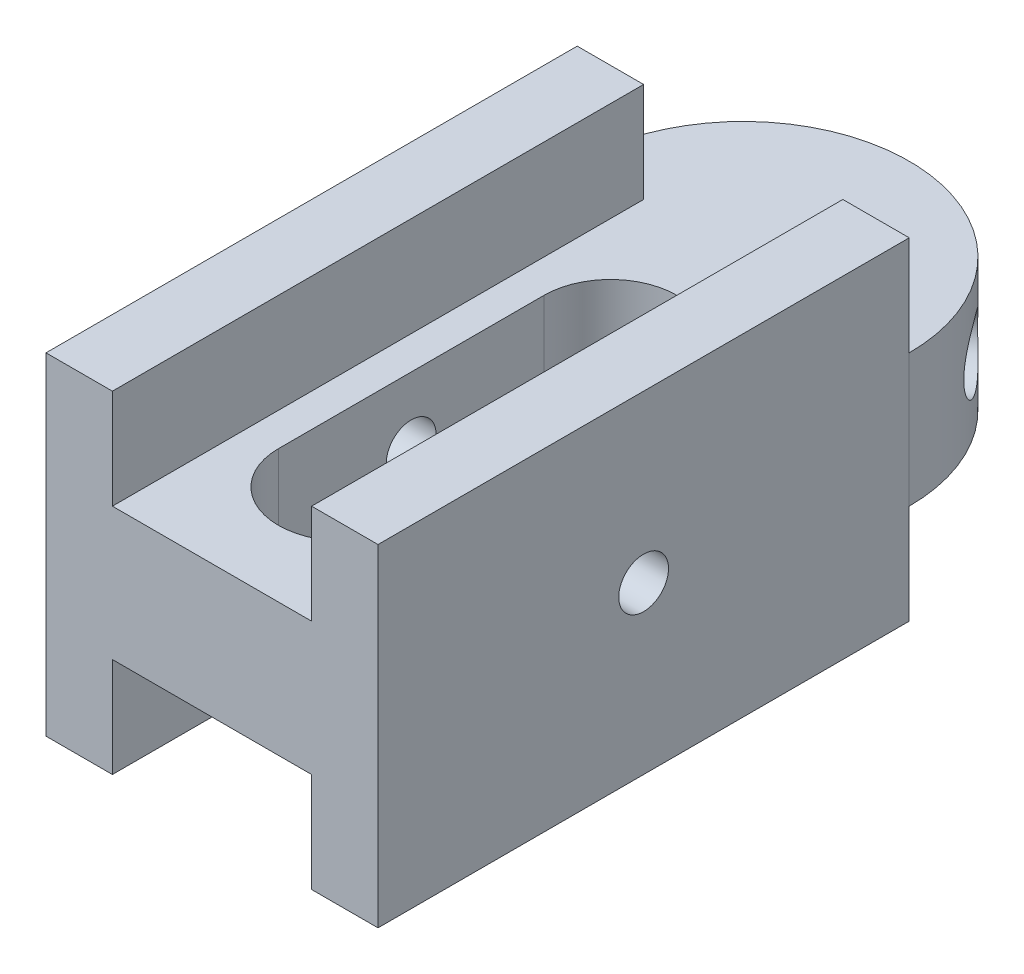
ISO-10303-21;
HEADER;
FILE_DESCRIPTION(('STEP AP214'),'2;1');
FILE_NAME('part.step','',(''),(''),'','','');
FILE_SCHEMA(('AUTOMOTIVE_DESIGN { 1 0 10303 214 1 1 1 1 }'));
ENDSEC;
DATA;
#1=APPLICATION_CONTEXT('core data for automotive mechanical design processes');
#2=APPLICATION_PROTOCOL_DEFINITION('international standard','automotive_design',2000,#1);
#3=PRODUCT_CONTEXT('',#1,'mechanical');
#4=PRODUCT('Part','Part','',(#3));
#5=PRODUCT_RELATED_PRODUCT_CATEGORY('part','',(#4));
#6=PRODUCT_DEFINITION_FORMATION('','',#4);
#7=PRODUCT_DEFINITION_CONTEXT('part definition',#1,'design');
#8=PRODUCT_DEFINITION('design','',#6,#7);
#9=PRODUCT_DEFINITION_SHAPE('','',#8);
#10=(LENGTH_UNIT() NAMED_UNIT(*) SI_UNIT(.MILLI.,.METRE.));
#11=(NAMED_UNIT(*) PLANE_ANGLE_UNIT() SI_UNIT($,.RADIAN.));
#12=(NAMED_UNIT(*) SI_UNIT($,.STERADIAN.) SOLID_ANGLE_UNIT());
#13=UNCERTAINTY_MEASURE_WITH_UNIT(LENGTH_MEASURE(1.E-05),#10,'distance_accuracy_value','');
#14=(GEOMETRIC_REPRESENTATION_CONTEXT(3) GLOBAL_UNCERTAINTY_ASSIGNED_CONTEXT((#13)) GLOBAL_UNIT_ASSIGNED_CONTEXT((#10,
#11,#12)) REPRESENTATION_CONTEXT('',''));
#15=CARTESIAN_POINT('',(0.,0.,0.));
#16=DIRECTION('',(0.,0.,1.));
#17=DIRECTION('',(1.,0.,0.));
#18=AXIS2_PLACEMENT_3D('',#15,#16,#17);
#19=CARTESIAN_POINT('',(-7.9375,0.,12.7));
#20=DIRECTION('',(1.,0.,0.));
#21=DIRECTION('',(0.,0.,-1.));
#22=AXIS2_PLACEMENT_3D('',#19,#20,#21);
#23=CYLINDRICAL_SURFACE('',#22,1.190625);
#24=CARTESIAN_POINT('',(3.175,0.,12.7));
#25=DIRECTION('',(1.,0.,0.));
#26=DIRECTION('',(0.,0.,-1.));
#27=AXIS2_PLACEMENT_3D('',#24,#25,#26);
#28=CIRCLE('',#27,1.190625);
#29=CARTESIAN_POINT('',(3.175,0.,11.509375));
#30=VERTEX_POINT('',#29);
#31=EDGE_CURVE('E194',#30,#30,#28,.F.);
#32=ORIENTED_EDGE('',*,*,#31,.T.);
#33=EDGE_LOOP('',(#32));
#34=FACE_BOUND('',#33,.T.);
#35=CARTESIAN_POINT('',(7.9375,0.,12.7));
#36=DIRECTION('',(1.,0.,0.));
#37=DIRECTION('',(0.,0.,-1.));
#38=AXIS2_PLACEMENT_3D('',#35,#36,#37);
#39=CIRCLE('',#38,1.190625);
#40=CARTESIAN_POINT('',(7.9375,0.,11.509375));
#41=VERTEX_POINT('',#40);
#42=EDGE_CURVE('E338',#41,#41,#39,.T.);
#43=ORIENTED_EDGE('',*,*,#42,.T.);
#44=EDGE_LOOP('',(#43));
#45=FACE_BOUND('',#44,.T.);
#46=ADVANCED_FACE('F33',(#34,#45),#23,.F.);
#47=CARTESIAN_POINT('',(-7.9375,-7.9375,25.4));
#48=DIRECTION('',(0.,1.,0.));
#49=DIRECTION('',(0.,0.,1.));
#50=AXIS2_PLACEMENT_3D('',#47,#48,#49);
#51=PLANE('',#50);
#52=DIRECTION('',(1.,0.,0.));
#53=VECTOR('',#52,1.);
#54=CARTESIAN_POINT('',(-7.9375,-7.9375,25.4));
#55=LINE('',#54,#53);
#56=CARTESIAN_POINT('',(4.7625,-7.9375,25.4));
#57=VERTEX_POINT('',#56);
#58=CARTESIAN_POINT('',(7.9375,-7.9375,25.4));
#59=VERTEX_POINT('',#58);
#60=EDGE_CURVE('E372',#57,#59,#55,.T.);
#61=ORIENTED_EDGE('',*,*,#60,.F.);
#62=DIRECTION('',(0.,0.,-1.));
#63=VECTOR('',#62,1.);
#64=CARTESIAN_POINT('',(4.7625,-7.9375,25.4));
#65=LINE('',#64,#63);
#66=CARTESIAN_POINT('',(4.7625,-7.9375,0.));
#67=VERTEX_POINT('',#66);
#68=EDGE_CURVE('E209',#57,#67,#65,.T.);
#69=ORIENTED_EDGE('',*,*,#68,.T.);
#70=DIRECTION('',(1.,0.,0.));
#71=VECTOR('',#70,1.);
#72=CARTESIAN_POINT('',(-7.9375,-7.9375,0.));
#73=LINE('',#72,#71);
#74=CARTESIAN_POINT('',(7.9375,-7.9375,0.));
#75=VERTEX_POINT('',#74);
#76=EDGE_CURVE('E388',#67,#75,#73,.T.);
#77=ORIENTED_EDGE('',*,*,#76,.T.);
#78=DIRECTION('',(0.,0.,-1.));
#79=VECTOR('',#78,1.);
#80=CARTESIAN_POINT('',(7.9375,-7.9375,25.4));
#81=LINE('',#80,#79);
#82=EDGE_CURVE('E376',#59,#75,#81,.T.);
#83=ORIENTED_EDGE('',*,*,#82,.F.);
#84=EDGE_LOOP('',(#61,#69,#77,#83));
#85=FACE_BOUND('',#84,.T.);
#86=ADVANCED_FACE('F316',(#85),#51,.F.);
#87=CARTESIAN_POINT('',(0.,0.,0.));
#88=DIRECTION('',(0.,0.,1.));
#89=DIRECTION('',(1.,0.,0.));
#90=AXIS2_PLACEMENT_3D('',#87,#88,#89);
#91=PLANE('',#90);
#92=ORIENTED_EDGE('',*,*,#76,.F.);
#93=DIRECTION('',(0.,-1.,0.));
#94=VECTOR('',#93,1.);
#95=CARTESIAN_POINT('',(4.7625,-7.9375,0.));
#96=LINE('',#95,#94);
#97=CARTESIAN_POINT('',(4.7625,-3.175,0.));
#98=VERTEX_POINT('',#97);
#99=EDGE_CURVE('E198',#98,#67,#96,.T.);
#100=ORIENTED_EDGE('',*,*,#99,.F.);
#101=DIRECTION('',(1.,0.,0.));
#102=VECTOR('',#101,1.);
#103=CARTESIAN_POINT('',(-7.9375,-3.175,0.));
#104=LINE('',#103,#102);
#105=CARTESIAN_POINT('',(7.9375,-3.175,0.));
#106=VERTEX_POINT('',#105);
#107=EDGE_CURVE('E351',#98,#106,#104,.T.);
#108=ORIENTED_EDGE('',*,*,#107,.T.);
#109=DIRECTION('',(0.,1.,0.));
#110=VECTOR('',#109,1.);
#111=CARTESIAN_POINT('',(7.9375,7.9375,0.));
#112=LINE('',#111,#110);
#113=EDGE_CURVE('E377',#75,#106,#112,.T.);
#114=ORIENTED_EDGE('',*,*,#113,.F.);
#115=EDGE_LOOP('',(#92,#100,#108,#114));
#116=FACE_BOUND('',#115,.T.);
#117=ADVANCED_FACE('F321',(#116),#91,.F.);
#118=DIRECTION('',(1.,0.,0.));
#119=VECTOR('',#118,1.);
#120=CARTESIAN_POINT('',(-7.9375,3.175,0.));
#121=LINE('',#120,#119);
#122=CARTESIAN_POINT('',(4.7625,3.175,0.));
#123=VERTEX_POINT('',#122);
#124=CARTESIAN_POINT('',(7.9375,3.175,0.));
#125=VERTEX_POINT('',#124);
#126=EDGE_CURVE('E340',#123,#125,#121,.T.);
#127=ORIENTED_EDGE('',*,*,#126,.F.);
#128=DIRECTION('',(0.,-1.,0.));
#129=VECTOR('',#128,1.);
#130=CARTESIAN_POINT('',(4.7625,7.9375,0.));
#131=LINE('',#130,#129);
#132=CARTESIAN_POINT('',(4.7625,7.9375,0.));
#133=VERTEX_POINT('',#132);
#134=EDGE_CURVE('E214',#133,#123,#131,.T.);
#135=ORIENTED_EDGE('',*,*,#134,.F.);
#136=DIRECTION('',(-1.,0.,0.));
#137=VECTOR('',#136,1.);
#138=CARTESIAN_POINT('',(-7.9375,7.9375,0.));
#139=LINE('',#138,#137);
#140=CARTESIAN_POINT('',(7.9375,7.9375,0.));
#141=VERTEX_POINT('',#140);
#142=EDGE_CURVE('E381',#141,#133,#139,.T.);
#143=ORIENTED_EDGE('',*,*,#142,.F.);
#144=EDGE_CURVE('E359',#125,#141,#112,.T.);
#145=ORIENTED_EDGE('',*,*,#144,.F.);
#146=EDGE_LOOP('',(#127,#135,#143,#145));
#147=FACE_BOUND('',#146,.T.);
#148=ADVANCED_FACE('F415',(#147),#91,.F.);
#149=CARTESIAN_POINT('',(-7.9375,7.9375,25.4));
#150=DIRECTION('',(0.,-1.,0.));
#151=DIRECTION('',(0.,0.,-1.));
#152=AXIS2_PLACEMENT_3D('',#149,#150,#151);
#153=PLANE('',#152);
#154=ORIENTED_EDGE('',*,*,#142,.T.);
#155=DIRECTION('',(0.,0.,-1.));
#156=VECTOR('',#155,1.);
#157=CARTESIAN_POINT('',(4.7625,7.9375,25.4));
#158=LINE('',#157,#156);
#159=CARTESIAN_POINT('',(4.7625,7.9375,25.4));
#160=VERTEX_POINT('',#159);
#161=EDGE_CURVE('E235',#160,#133,#158,.T.);
#162=ORIENTED_EDGE('',*,*,#161,.F.);
#163=DIRECTION('',(-1.,0.,0.));
#164=VECTOR('',#163,1.);
#165=CARTESIAN_POINT('',(-7.9375,7.9375,25.4));
#166=LINE('',#165,#164);
#167=CARTESIAN_POINT('',(7.9375,7.9375,25.4));
#168=VERTEX_POINT('',#167);
#169=EDGE_CURVE('E367',#168,#160,#166,.T.);
#170=ORIENTED_EDGE('',*,*,#169,.F.);
#171=DIRECTION('',(0.,0.,-1.));
#172=VECTOR('',#171,1.);
#173=CARTESIAN_POINT('',(7.9375,7.9375,25.4));
#174=LINE('',#173,#172);
#175=EDGE_CURVE('E291',#168,#141,#174,.T.);
#176=ORIENTED_EDGE('',*,*,#175,.T.);
#177=EDGE_LOOP('',(#154,#162,#170,#176));
#178=FACE_BOUND('',#177,.T.);
#179=ADVANCED_FACE('F404',(#178),#153,.F.);
#180=CARTESIAN_POINT('',(0.,-3.175,0.));
#181=DIRECTION('',(0.,1.,0.));
#182=DIRECTION('',(0.,0.,1.));
#183=AXIS2_PLACEMENT_3D('',#180,#181,#182);
#184=CYLINDRICAL_SURFACE('',#183,7.9375);
#185=CARTESIAN_POINT('',(5.30741807885636,0.,-5.9021368661044));
#186=CARTESIAN_POINT('',(5.30742142824719,0.088208446091181,-5.90213528792591));
#187=CARTESIAN_POINT('',(5.31302545055899,0.176457964541402,-5.89710929511124));
#188=CARTESIAN_POINT('',(5.3351722673734,0.350460476914998,-5.8770790143385));
#189=CARTESIAN_POINT('',(5.35172381460835,0.436211415859692,-5.86206674212518));
#190=CARTESIAN_POINT('',(5.3949314172603,0.602674219074736,-5.82232568278678));
#191=CARTESIAN_POINT('',(5.4215774218693,0.683391002932966,-5.79760655964717));
#192=CARTESIAN_POINT('',(5.48373789343284,0.837683815956437,-5.73884535919804));
#193=CARTESIAN_POINT('',(5.51925186540756,0.911260243353925,-5.70480380222485));
#194=CARTESIAN_POINT('',(5.59811800427489,1.050228093618,-5.6274383613423));
#195=CARTESIAN_POINT('',(5.64156388746423,1.11550384576581,-5.5840022046874));
#196=CARTESIAN_POINT('',(5.73419671938564,1.23500758455663,-5.48883372916533));
#197=CARTESIAN_POINT('',(5.78338407017435,1.28923479677479,-5.43710082920875));
#198=CARTESIAN_POINT('',(5.88603929246622,1.38555097798518,-5.32580694044865));
#199=CARTESIAN_POINT('',(5.93954073689199,1.42753002818391,-5.26618165088558));
#200=CARTESIAN_POINT('',(6.04843321468653,1.49744896256392,-5.1407441939428));
#201=CARTESIAN_POINT('',(6.10382407066019,1.52539016089282,-5.07493260637577));
#202=CARTESIAN_POINT('',(6.2137959102707,1.56608016987115,-4.93964998218976));
#203=CARTESIAN_POINT('',(6.2683779486696,1.57902430189397,-4.87023858679998));
#204=CARTESIAN_POINT('',(6.37570291501248,1.58996213604333,-4.7288678358511));
#205=CARTESIAN_POINT('',(6.42844601968342,1.58795727881274,-4.65690872648188));
#206=CARTESIAN_POINT('',(6.52984765588061,1.56920218890781,-4.51360115377548));
#207=CARTESIAN_POINT('',(6.57855365867142,1.55266234874604,-4.44225858768382));
#208=CARTESIAN_POINT('',(6.67155789248689,1.50564051097151,-4.30132013519287));
#209=CARTESIAN_POINT('',(6.71585594706625,1.4751579555204,-4.23172431879737));
#210=CARTESIAN_POINT('',(6.79947934235925,1.40092106126621,-4.09602071508204));
#211=CARTESIAN_POINT('',(6.83877158607387,1.35708429512099,-4.02993767305721));
#212=CARTESIAN_POINT('',(6.91151991471259,1.2574443398869,-3.90385767640881));
#213=CARTESIAN_POINT('',(6.94497532728666,1.2016397738643,-3.84386142326081));
#214=CARTESIAN_POINT('',(7.00627775271569,1.0784941249028,-3.73097613239765));
#215=CARTESIAN_POINT('',(7.03401684858177,1.01096891606678,-3.67822919878848));
#216=CARTESIAN_POINT('',(7.08299271897506,0.866907647609431,-3.58301490082521));
#217=CARTESIAN_POINT('',(7.10422937051964,0.790371417597926,-3.54054773089846));
#218=CARTESIAN_POINT('',(7.14018910912204,0.630204429482883,-3.46745963352409));
#219=CARTESIAN_POINT('',(7.15489815919133,0.546558838872036,-3.43686425280225));
#220=CARTESIAN_POINT('',(7.17772570275209,0.374695523588163,-3.38893374079344));
#221=CARTESIAN_POINT('',(7.18584505520268,0.286478396404704,-3.37159688129129));
#222=CARTESIAN_POINT('',(7.19541661538912,0.109593287926516,-3.35112115153449));
#223=CARTESIAN_POINT('',(7.19698052890861,0.0209588507823337,-3.34774441227494));
#224=CARTESIAN_POINT('',(7.19374892611546,-0.155651554329498,-3.35468281804255));
#225=CARTESIAN_POINT('',(7.18895377041467,-0.243627559351196,-3.36499718667058));
#226=CARTESIAN_POINT('',(7.17307883344871,-0.415557716463924,-3.39870332621606));
#227=CARTESIAN_POINT('',(7.16205975572642,-0.499542344569274,-3.42196875086241));
#228=CARTESIAN_POINT('',(7.13378125407026,-0.662087955458127,-3.48053476824228));
#229=CARTESIAN_POINT('',(7.11652131606826,-0.740648490816707,-3.51583635239691));
#230=CARTESIAN_POINT('',(7.07551479463277,-0.891243312045881,-3.59765338054844));
#231=CARTESIAN_POINT('',(7.05168659470332,-0.963179186002563,-3.64430899179188));
#232=CARTESIAN_POINT('',(6.99772606766657,-1.09745194530145,-3.74687689707799));
#233=CARTESIAN_POINT('',(6.96759309167438,-1.15978784147069,-3.80279014378889));
#234=CARTESIAN_POINT('',(6.90071299839356,-1.2740680627071,-3.92286270925963));
#235=CARTESIAN_POINT('',(6.86387144818958,-1.32583817675687,-3.9871354375248));
#236=CARTESIAN_POINT('',(6.78431756336041,-1.41628158688059,-4.1210432548811));
#237=CARTESIAN_POINT('',(6.74160547538674,-1.45495543295984,-4.19067811862728));
#238=CARTESIAN_POINT('',(6.65128624990302,-1.51785458389778,-4.33258865784384));
#239=CARTESIAN_POINT('',(6.60370872243753,-1.54216182268418,-4.40484681353503));
#240=CARTESIAN_POINT('',(6.50450923616225,-1.57589735566635,-4.5500539090892));
#241=CARTESIAN_POINT('',(6.45288776525973,-1.58532744191765,-4.6230027646875));
#242=CARTESIAN_POINT('',(6.34792061291017,-1.58897158227858,-4.76608303769136));
#243=CARTESIAN_POINT('',(6.29462056576492,-1.58344755772424,-4.83624139285228));
#244=CARTESIAN_POINT('',(6.18706385258694,-1.55791860350535,-4.97310002647535));
#245=CARTESIAN_POINT('',(6.13280719859102,-1.53791385592243,-5.03980034840776));
#246=CARTESIAN_POINT('',(6.02524162962511,-1.48410772505451,-5.16791603173537));
#247=CARTESIAN_POINT('',(5.97193084039241,-1.45033781221674,-5.2293430638694));
#248=CARTESIAN_POINT('',(5.86797400571607,-1.3699930668872,-5.34573510315036));
#249=CARTESIAN_POINT('',(5.8173281712274,-1.32341722250285,-5.40069959915372));
#250=CARTESIAN_POINT('',(5.71976316090902,-1.21789922303894,-5.50393932705422));
#251=CARTESIAN_POINT('',(5.67291728595736,-1.15876969098599,-5.55209234011034));
#252=CARTESIAN_POINT('',(5.58572817345819,-1.03020774384797,-5.63980327340856));
#253=CARTESIAN_POINT('',(5.54538647860808,-0.960772891968417,-5.6793591553076));
#254=CARTESIAN_POINT('',(5.47253341473343,-0.812674084738426,-5.74959821973526));
#255=CARTESIAN_POINT('',(5.44011107086978,-0.733918774157767,-5.7801812403325));
#256=CARTESIAN_POINT('',(5.38520102912634,-0.570019222386886,-5.83137520031411));
#257=CARTESIAN_POINT('',(5.36270432024839,-0.484880858567618,-5.85199518627479));
#258=CARTESIAN_POINT('',(5.33306984614609,-0.33295835199403,-5.87899283924023));
#259=CARTESIAN_POINT('',(5.32347675561572,-0.267040646524185,-5.88766305888373));
#260=CARTESIAN_POINT('',(5.31064970846806,-0.134089847147479,-5.89923557276431));
#261=CARTESIAN_POINT('',(5.30741553262169,-0.0670567917736239,-5.90213806584877));
#262=CARTESIAN_POINT('',(5.30741807885636,0.,-5.9021368661044));
#263=B_SPLINE_CURVE_WITH_KNOTS('',3,(#185,#186,#187,#188,#189,#190,#191,#192,#193,#194,#195,
#196,#197,#198,#199,#200,#201,#202,#203,#204,#205,#206,#207,#208,#209,#210,#211,#212,#213,#214,
#215,#216,#217,#218,#219,#220,#221,#222,#223,#224,#225,#226,#227,#228,#229,#230,#231,#232,#233,
#234,#235,#236,#237,#238,#239,#240,#241,#242,#243,#244,#245,#246,#247,#248,#249,#250,#251,#252,
#253,#254,#255,#256,#257,#258,#259,#260,#261,#262),.UNSPECIFIED.,.T.,.F.,(4,2,2,2,2,2,2,2,2,2,2,
2,2,2,2,2,2,2,2,2,2,2,2,2,2,2,2,2,2,2,2,2,2,2,2,2,2,2,4),(0.,0.264379811392717,
0.528971254863821,0.79329994048068,1.05761387546503,1.32528075920643,1.59296639806232,
1.86298523194452,2.13297878341414,2.3994149510189,2.66582544234544,2.92844203543241,
3.19106913654579,3.45535129702906,3.7196638803498,3.98858337985442,4.25750796519818,
4.52700807786783,4.79647305587939,5.06132715514792,5.32616623563869,5.58846580081019,
5.85078697687608,6.11652732392052,6.38229503431457,6.65214255251853,6.92197873650291,
7.19026079056107,7.45851052572959,7.72209240145814,7.98567096294726,8.2486502710728,
8.51165036513811,8.77889328840635,9.04619950487528,9.31638501494228,9.58632472953681,
9.78731538273572,9.98829910648691),.UNSPECIFIED.);
#264=CARTESIAN_POINT('',(5.30741807885636,0.,-5.9021368661044));
#265=VERTEX_POINT('',#264);
#266=EDGE_CURVE('E284',#265,#265,#263,.T.);
#267=ORIENTED_EDGE('',*,*,#266,.F.);
#268=EDGE_LOOP('',(#267));
#269=FACE_BOUND('',#268,.T.);
#270=DIRECTION('',(0.,1.,0.));
#271=VECTOR('',#270,1.);
#272=CARTESIAN_POINT('',(-7.9375,-3.175,0.));
#273=LINE('',#272,#271);
#274=CARTESIAN_POINT('',(-7.9375,-3.175,0.));
#275=VERTEX_POINT('',#274);
#276=CARTESIAN_POINT('',(-7.9375,3.175,0.));
#277=VERTEX_POINT('',#276);
#278=EDGE_CURVE('E355',#275,#277,#273,.T.);
#279=ORIENTED_EDGE('',*,*,#278,.T.);
#280=CARTESIAN_POINT('',(0.,3.175,0.));
#281=DIRECTION('',(0.,1.,0.));
#282=DIRECTION('',(0.,0.,-1.));
#283=AXIS2_PLACEMENT_3D('',#280,#281,#282);
#284=CIRCLE('',#283,7.9375);
#285=EDGE_CURVE('E337',#125,#277,#284,.T.);
#286=ORIENTED_EDGE('',*,*,#285,.F.);
#287=DIRECTION('',(0.,1.,0.));
#288=VECTOR('',#287,1.);
#289=CARTESIAN_POINT('',(7.9375,-3.175,0.));
#290=LINE('',#289,#288);
#291=EDGE_CURVE('E356',#106,#125,#290,.T.);
#292=ORIENTED_EDGE('',*,*,#291,.F.);
#293=CARTESIAN_POINT('',(0.,-3.175,0.));
#294=DIRECTION('',(0.,1.,0.));
#295=DIRECTION('',(0.,0.,-1.));
#296=AXIS2_PLACEMENT_3D('',#293,#294,#295);
#297=CIRCLE('',#296,7.9375);
#298=EDGE_CURVE('E348',#106,#275,#297,.T.);
#299=ORIENTED_EDGE('',*,*,#298,.T.);
#300=EDGE_LOOP('',(#279,#286,#292,#299));
#301=FACE_BOUND('',#300,.T.);
#302=CARTESIAN_POINT('',(-5.9021368661044,0.,-5.30741807885636));
#303=CARTESIAN_POINT('',(-5.90213528792592,-0.0882084460911809,-5.30742142824719));
#304=CARTESIAN_POINT('',(-5.89710929511125,-0.176457964541402,-5.313025450559));
#305=CARTESIAN_POINT('',(-5.8770790143385,-0.350460476914997,-5.3351722673734));
#306=CARTESIAN_POINT('',(-5.86206674212518,-0.436211415859692,-5.35172381460835));
#307=CARTESIAN_POINT('',(-5.82232568278678,-0.602674219074736,-5.3949314172603));
#308=CARTESIAN_POINT('',(-5.79760655964718,-0.683391002932965,-5.4215774218693));
#309=CARTESIAN_POINT('',(-5.73884535919805,-0.837683815956436,-5.48373789343284));
#310=CARTESIAN_POINT('',(-5.70480380222485,-0.911260243353925,-5.51925186540756));
#311=CARTESIAN_POINT('',(-5.6274383613423,-1.050228093618,-5.59811800427489));
#312=CARTESIAN_POINT('',(-5.58400220468741,-1.1155038457658,-5.64156388746423));
#313=CARTESIAN_POINT('',(-5.48883372916533,-1.23500758455663,-5.73419671938564));
#314=CARTESIAN_POINT('',(-5.43710082920875,-1.28923479677479,-5.78338407017435));
#315=CARTESIAN_POINT('',(-5.32580694044866,-1.38555097798518,-5.88603929246622));
#316=CARTESIAN_POINT('',(-5.26618165088559,-1.42753002818391,-5.93954073689199));
#317=CARTESIAN_POINT('',(-5.1407441939428,-1.49744896256392,-6.04843321468653));
#318=CARTESIAN_POINT('',(-5.07493260637577,-1.52539016089282,-6.10382407066019));
#319=CARTESIAN_POINT('',(-4.93964998218977,-1.56608016987115,-6.2137959102707));
#320=CARTESIAN_POINT('',(-4.87023858679998,-1.57902430189397,-6.2683779486696));
#321=CARTESIAN_POINT('',(-4.7288678358511,-1.58996213604333,-6.37570291501248));
#322=CARTESIAN_POINT('',(-4.65690872648188,-1.58795727881274,-6.42844601968342));
#323=CARTESIAN_POINT('',(-4.51360115377549,-1.56920218890781,-6.52984765588061));
#324=CARTESIAN_POINT('',(-4.44225858768382,-1.55266234874604,-6.57855365867142));
#325=CARTESIAN_POINT('',(-4.30132013519288,-1.50564051097151,-6.67155789248689));
#326=CARTESIAN_POINT('',(-4.23172431879738,-1.4751579555204,-6.71585594706626));
#327=CARTESIAN_POINT('',(-4.09602071508204,-1.40092106126621,-6.79947934235925));
#328=CARTESIAN_POINT('',(-4.02993767305721,-1.35708429512099,-6.83877158607387));
#329=CARTESIAN_POINT('',(-3.90385767640881,-1.2574443398869,-6.91151991471259));
#330=CARTESIAN_POINT('',(-3.84386142326081,-1.20163977386431,-6.94497532728666));
#331=CARTESIAN_POINT('',(-3.73097613239766,-1.0784941249028,-7.00627775271569));
#332=CARTESIAN_POINT('',(-3.67822919878849,-1.01096891606678,-7.03401684858177));
#333=CARTESIAN_POINT('',(-3.58301490082521,-0.866907647609431,-7.08299271897506));
#334=CARTESIAN_POINT('',(-3.54054773089847,-0.790371417597928,-7.10422937051964));
#335=CARTESIAN_POINT('',(-3.46745963352409,-0.630204429482885,-7.14018910912204));
#336=CARTESIAN_POINT('',(-3.43686425280225,-0.546558838872037,-7.15489815919133));
#337=CARTESIAN_POINT('',(-3.38893374079345,-0.374695523588164,-7.17772570275209));
#338=CARTESIAN_POINT('',(-3.3715968812913,-0.286478396404705,-7.18584505520268));
#339=CARTESIAN_POINT('',(-3.35112115153449,-0.109593287926517,-7.19541661538912));
#340=CARTESIAN_POINT('',(-3.34774441227495,-0.0209588507823349,-7.19698052890861));
#341=CARTESIAN_POINT('',(-3.35468281804255,0.155651554329497,-7.19374892611546));
#342=CARTESIAN_POINT('',(-3.36499718667058,0.243627559351195,-7.18895377041468));
#343=CARTESIAN_POINT('',(-3.39870332621606,0.415557716463923,-7.17307883344871));
#344=CARTESIAN_POINT('',(-3.42196875086241,0.499542344569273,-7.16205975572643));
#345=CARTESIAN_POINT('',(-3.48053476824229,0.662087955458127,-7.13378125407026));
#346=CARTESIAN_POINT('',(-3.51583635239691,0.740648490816706,-7.11652131606826));
#347=CARTESIAN_POINT('',(-3.59765338054844,0.891243312045881,-7.07551479463277));
#348=CARTESIAN_POINT('',(-3.64430899179189,0.963179186002562,-7.05168659470332));
#349=CARTESIAN_POINT('',(-3.74687689707799,1.09745194530145,-6.99772606766657));
#350=CARTESIAN_POINT('',(-3.80279014378889,1.15978784147069,-6.96759309167438));
#351=CARTESIAN_POINT('',(-3.92286270925963,1.2740680627071,-6.90071299839356));
#352=CARTESIAN_POINT('',(-3.9871354375248,1.32583817675687,-6.86387144818958));
#353=CARTESIAN_POINT('',(-4.1210432548811,1.41628158688059,-6.78431756336041));
#354=CARTESIAN_POINT('',(-4.19067811862728,1.45495543295984,-6.74160547538674));
#355=CARTESIAN_POINT('',(-4.33258865784384,1.51785458389778,-6.65128624990303));
#356=CARTESIAN_POINT('',(-4.40484681353503,1.54216182268417,-6.60370872243753));
#357=CARTESIAN_POINT('',(-4.5500539090892,1.57589735566635,-6.50450923616225));
#358=CARTESIAN_POINT('',(-4.6230027646875,1.58532744191765,-6.45288776525973));
#359=CARTESIAN_POINT('',(-4.76608303769136,1.58897158227858,-6.34792061291017));
#360=CARTESIAN_POINT('',(-4.83624139285228,1.58344755772424,-6.29462056576492));
#361=CARTESIAN_POINT('',(-4.97310002647535,1.55791860350535,-6.18706385258694));
#362=CARTESIAN_POINT('',(-5.03980034840776,1.53791385592243,-6.13280719859102));
#363=CARTESIAN_POINT('',(-5.16791603173537,1.48410772505451,-6.02524162962511));
#364=CARTESIAN_POINT('',(-5.2293430638694,1.45033781221675,-5.97193084039241));
#365=CARTESIAN_POINT('',(-5.34573510315036,1.3699930668872,-5.86797400571607));
#366=CARTESIAN_POINT('',(-5.40069959915372,1.32341722250285,-5.8173281712274));
#367=CARTESIAN_POINT('',(-5.50393932705422,1.21789922303894,-5.71976316090902));
#368=CARTESIAN_POINT('',(-5.55209234011034,1.15876969098599,-5.67291728595736));
#369=CARTESIAN_POINT('',(-5.63980327340857,1.03020774384797,-5.58572817345819));
#370=CARTESIAN_POINT('',(-5.6793591553076,0.960772891968419,-5.54538647860808));
#371=CARTESIAN_POINT('',(-5.74959821973527,0.812674084738428,-5.47253341473343));
#372=CARTESIAN_POINT('',(-5.7801812403325,0.73391877415777,-5.44011107086978));
#373=CARTESIAN_POINT('',(-5.83137520031411,0.570019222386888,-5.38520102912635));
#374=CARTESIAN_POINT('',(-5.85199518627479,0.48488085856762,-5.36270432024839));
#375=CARTESIAN_POINT('',(-5.87899283924023,0.332958351994031,-5.33306984614609));
#376=CARTESIAN_POINT('',(-5.88766305888373,0.267040646524186,-5.32347675561572));
#377=CARTESIAN_POINT('',(-5.89923557276431,0.13408984714748,-5.31064970846806));
#378=CARTESIAN_POINT('',(-5.90213806584877,0.0670567917736245,-5.30741553262169));
#379=CARTESIAN_POINT('',(-5.9021368661044,0.,-5.30741807885636));
#380=B_SPLINE_CURVE_WITH_KNOTS('',3,(#302,#303,#304,#305,#306,#307,#308,#309,#310,#311,#312,
#313,#314,#315,#316,#317,#318,#319,#320,#321,#322,#323,#324,#325,#326,#327,#328,#329,#330,#331,
#332,#333,#334,#335,#336,#337,#338,#339,#340,#341,#342,#343,#344,#345,#346,#347,#348,#349,#350,
#351,#352,#353,#354,#355,#356,#357,#358,#359,#360,#361,#362,#363,#364,#365,#366,#367,#368,#369,
#370,#371,#372,#373,#374,#375,#376,#377,#378,#379),.UNSPECIFIED.,.T.,.F.,(4,2,2,2,2,2,2,2,2,2,2,
2,2,2,2,2,2,2,2,2,2,2,2,2,2,2,2,2,2,2,2,2,2,2,2,2,2,2,4),(0.,0.264379811392717,
0.528971254863821,0.79329994048068,1.05761387546503,1.32528075920643,1.59296639806232,
1.86298523194452,2.13297878341413,2.3994149510189,2.66582544234544,2.92844203543241,
3.19106913654579,3.45535129702906,3.7196638803498,3.98858337985442,4.25750796519818,
4.52700807786783,4.79647305587939,5.06132715514792,5.32616623563869,5.58846580081019,
5.85078697687607,6.11652732392052,6.38229503431457,6.65214255251853,6.92197873650291,
7.19026079056107,7.45851052572959,7.72209240145814,7.98567096294726,8.24865027107279,
8.51165036513811,8.77889328840635,9.04619950487527,9.31638501494228,9.58632472953681,
9.78731538273572,9.98829910648691),.UNSPECIFIED.);
#381=CARTESIAN_POINT('',(-5.9021368661044,0.,-5.30741807885636));
#382=VERTEX_POINT('',#381);
#383=EDGE_CURVE('E250',#382,#382,#380,.T.);
#384=ORIENTED_EDGE('',*,*,#383,.T.);
#385=EDGE_LOOP('',(#384));
#386=FACE_BOUND('',#385,.T.);
#387=ADVANCED_FACE('F259',(#269,#301,#386),#184,.T.);
#388=CARTESIAN_POINT('',(0.,0.,0.));
#389=DIRECTION('',(0.803856860617214,0.,-0.594822786751345));
#390=DIRECTION('',(-0.594822786751345,0.,-0.803856860617214));
#391=AXIS2_PLACEMENT_3D('',#388,#389,#390);
#392=CYLINDRICAL_SURFACE('',#391,1.5875);
#393=ORIENTED_EDGE('',*,*,#266,.T.);
#394=EDGE_LOOP('',(#393));
#395=FACE_BOUND('',#394,.T.);
#396=CARTESIAN_POINT('',(0.,0.,0.));
#397=DIRECTION('',(0.989015863361917,0.,0.147809411129606));
#398=DIRECTION('',(0.147809411129606,0.,-0.989015863361917));
#399=AXIS2_PLACEMENT_3D('',#396,#397,#398);
#400=ELLIPSE('',#399,2.24506403026729,1.5875);
#401=CARTESIAN_POINT('',(0.,-1.5875,0.));
#402=VERTEX_POINT('',#401);
#403=CARTESIAN_POINT('',(0.,1.5875,0.));
#404=VERTEX_POINT('',#403);
#405=EDGE_CURVE('E247',#402,#404,#400,.T.);
#406=ORIENTED_EDGE('',*,*,#405,.F.);
#407=CARTESIAN_POINT('',(0.,0.,0.));
#408=DIRECTION('',(0.803856860617214,0.,-0.594822786751345));
#409=DIRECTION('',(-0.594822786751345,0.,-0.803856860617214));
#410=AXIS2_PLACEMENT_3D('',#407,#408,#409);
#411=CIRCLE('',#410,1.5875);
#412=EDGE_CURVE('E257',#404,#402,#411,.T.);
#413=ORIENTED_EDGE('',*,*,#412,.F.);
#414=EDGE_LOOP('',(#406,#413));
#415=FACE_BOUND('',#414,.T.);
#416=ADVANCED_FACE('F276',(#395,#415),#392,.F.);
#417=CARTESIAN_POINT('',(-4.7625,7.9375,0.));
#418=VERTEX_POINT('',#417);
#419=CARTESIAN_POINT('',(-7.9375,7.9375,0.));
#420=VERTEX_POINT('',#419);
#421=EDGE_CURVE('E380',#418,#420,#139,.T.);
#422=ORIENTED_EDGE('',*,*,#421,.F.);
#423=DIRECTION('',(0.,1.,0.));
#424=VECTOR('',#423,1.);
#425=CARTESIAN_POINT('',(-4.7625,7.9375,0.));
#426=LINE('',#425,#424);
#427=CARTESIAN_POINT('',(-4.7625,3.175,0.));
#428=VERTEX_POINT('',#427);
#429=EDGE_CURVE('E226',#428,#418,#426,.T.);
#430=ORIENTED_EDGE('',*,*,#429,.F.);
#431=EDGE_CURVE('E345',#277,#428,#121,.T.);
#432=ORIENTED_EDGE('',*,*,#431,.F.);
#433=DIRECTION('',(0.,-1.,0.));
#434=VECTOR('',#433,1.);
#435=CARTESIAN_POINT('',(-7.9375,7.9375,0.));
#436=LINE('',#435,#434);
#437=EDGE_CURVE('E385',#420,#277,#436,.T.);
#438=ORIENTED_EDGE('',*,*,#437,.F.);
#439=EDGE_LOOP('',(#422,#430,#432,#438));
#440=FACE_BOUND('',#439,.T.);
#441=ADVANCED_FACE('F280',(#440),#91,.F.);
#442=CARTESIAN_POINT('',(7.9375,7.9375,25.4));
#443=DIRECTION('',(-1.,0.,0.));
#444=DIRECTION('',(0.,0.,1.));
#445=AXIS2_PLACEMENT_3D('',#442,#443,#444);
#446=PLANE('',#445);
#447=ORIENTED_EDGE('',*,*,#42,.F.);
#448=EDGE_LOOP('',(#447));
#449=FACE_BOUND('',#448,.T.);
#450=ORIENTED_EDGE('',*,*,#113,.T.);
#451=ORIENTED_EDGE('',*,*,#291,.T.);
#452=ORIENTED_EDGE('',*,*,#144,.T.);
#453=ORIENTED_EDGE('',*,*,#175,.F.);
#454=DIRECTION('',(0.,1.,0.));
#455=VECTOR('',#454,1.);
#456=CARTESIAN_POINT('',(7.9375,7.9375,25.4));
#457=LINE('',#456,#455);
#458=EDGE_CURVE('E362',#59,#168,#457,.T.);
#459=ORIENTED_EDGE('',*,*,#458,.F.);
#460=ORIENTED_EDGE('',*,*,#82,.T.);
#461=EDGE_LOOP('',(#450,#451,#452,#453,#459,#460));
#462=FACE_BOUND('',#461,.T.);
#463=ADVANCED_FACE('F35',(#449,#462),#446,.F.);
#464=CARTESIAN_POINT('',(-4.7625,7.9375,25.4));
#465=VERTEX_POINT('',#464);
#466=CARTESIAN_POINT('',(-7.9375,7.9375,25.4));
#467=VERTEX_POINT('',#466);
#468=EDGE_CURVE('E365',#465,#467,#166,.T.);
#469=ORIENTED_EDGE('',*,*,#468,.F.);
#470=DIRECTION('',(0.,0.,-1.));
#471=VECTOR('',#470,1.);
#472=CARTESIAN_POINT('',(-4.7625,7.9375,25.4));
#473=LINE('',#472,#471);
#474=EDGE_CURVE('E238',#465,#418,#473,.T.);
#475=ORIENTED_EDGE('',*,*,#474,.T.);
#476=ORIENTED_EDGE('',*,*,#421,.T.);
#477=DIRECTION('',(0.,0.,-1.));
#478=VECTOR('',#477,1.);
#479=CARTESIAN_POINT('',(-7.9375,7.9375,25.4));
#480=LINE('',#479,#478);
#481=EDGE_CURVE('E395',#467,#420,#480,.T.);
#482=ORIENTED_EDGE('',*,*,#481,.F.);
#483=EDGE_LOOP('',(#469,#475,#476,#482));
#484=FACE_BOUND('',#483,.T.);
#485=ADVANCED_FACE('F452',(#484),#153,.F.);
#486=CARTESIAN_POINT('',(-7.9375,7.9375,25.4));
#487=DIRECTION('',(1.,0.,0.));
#488=DIRECTION('',(0.,0.,-1.));
#489=AXIS2_PLACEMENT_3D('',#486,#487,#488);
#490=PLANE('',#489);
#491=CARTESIAN_POINT('',(-7.9375,0.,12.7));
#492=DIRECTION('',(1.,0.,0.));
#493=DIRECTION('',(0.,0.,-1.));
#494=AXIS2_PLACEMENT_3D('',#491,#492,#493);
#495=CIRCLE('',#494,1.190625);
#496=CARTESIAN_POINT('',(-7.9375,0.,11.509375));
#497=VERTEX_POINT('',#496);
#498=EDGE_CURVE('E335',#497,#497,#495,.T.);
#499=ORIENTED_EDGE('',*,*,#498,.T.);
#500=EDGE_LOOP('',(#499));
#501=FACE_BOUND('',#500,.T.);
#502=ORIENTED_EDGE('',*,*,#437,.T.);
#503=ORIENTED_EDGE('',*,*,#278,.F.);
#504=CARTESIAN_POINT('',(-7.9375,-7.9375,0.));
#505=VERTEX_POINT('',#504);
#506=EDGE_CURVE('E384',#275,#505,#436,.T.);
#507=ORIENTED_EDGE('',*,*,#506,.T.);
#508=DIRECTION('',(0.,0.,-1.));
#509=VECTOR('',#508,1.);
#510=CARTESIAN_POINT('',(-7.9375,-7.9375,25.4));
#511=LINE('',#510,#509);
#512=CARTESIAN_POINT('',(-7.9375,-7.9375,25.4));
#513=VERTEX_POINT('',#512);
#514=EDGE_CURVE('E393',#513,#505,#511,.T.);
#515=ORIENTED_EDGE('',*,*,#514,.F.);
#516=DIRECTION('',(0.,-1.,0.));
#517=VECTOR('',#516,1.);
#518=CARTESIAN_POINT('',(-7.9375,7.9375,25.4));
#519=LINE('',#518,#517);
#520=EDGE_CURVE('E370',#467,#513,#519,.T.);
#521=ORIENTED_EDGE('',*,*,#520,.F.);
#522=ORIENTED_EDGE('',*,*,#481,.T.);
#523=EDGE_LOOP('',(#502,#503,#507,#515,#521,#522));
#524=FACE_BOUND('',#523,.T.);
#525=ADVANCED_FACE('F439',(#501,#524),#490,.F.);
#526=CARTESIAN_POINT('',(-4.7625,-7.9375,0.));
#527=VERTEX_POINT('',#526);
#528=EDGE_CURVE('E366',#505,#527,#73,.T.);
#529=ORIENTED_EDGE('',*,*,#528,.T.);
#530=DIRECTION('',(0.,0.,-1.));
#531=VECTOR('',#530,1.);
#532=CARTESIAN_POINT('',(-4.7625,-7.9375,25.4));
#533=LINE('',#532,#531);
#534=CARTESIAN_POINT('',(-4.7625,-7.9375,25.4));
#535=VERTEX_POINT('',#534);
#536=EDGE_CURVE('E218',#535,#527,#533,.T.);
#537=ORIENTED_EDGE('',*,*,#536,.F.);
#538=EDGE_CURVE('E373',#513,#535,#55,.T.);
#539=ORIENTED_EDGE('',*,*,#538,.F.);
#540=ORIENTED_EDGE('',*,*,#514,.T.);
#541=EDGE_LOOP('',(#529,#537,#539,#540));
#542=FACE_BOUND('',#541,.T.);
#543=ADVANCED_FACE('F324',(#542),#51,.F.);
#544=CARTESIAN_POINT('',(0.,0.,25.4));
#545=DIRECTION('',(0.,0.,1.));
#546=DIRECTION('',(1.,0.,0.));
#547=AXIS2_PLACEMENT_3D('',#544,#545,#546);
#548=PLANE('',#547);
#549=DIRECTION('',(0.,-1.,0.));
#550=VECTOR('',#549,1.);
#551=CARTESIAN_POINT('',(4.7625,-7.9375,25.4));
#552=LINE('',#551,#550);
#553=CARTESIAN_POINT('',(4.7625,-3.175,25.4));
#554=VERTEX_POINT('',#553);
#555=EDGE_CURVE('E199',#554,#57,#552,.T.);
#556=ORIENTED_EDGE('',*,*,#555,.T.);
#557=ORIENTED_EDGE('',*,*,#60,.T.);
#558=ORIENTED_EDGE('',*,*,#458,.T.);
#559=ORIENTED_EDGE('',*,*,#169,.T.);
#560=DIRECTION('',(0.,-1.,0.));
#561=VECTOR('',#560,1.);
#562=CARTESIAN_POINT('',(4.7625,7.9375,25.4));
#563=LINE('',#562,#561);
#564=CARTESIAN_POINT('',(4.7625,3.175,25.4));
#565=VERTEX_POINT('',#564);
#566=EDGE_CURVE('E222',#160,#565,#563,.T.);
#567=ORIENTED_EDGE('',*,*,#566,.T.);
#568=DIRECTION('',(-1.,0.,0.));
#569=VECTOR('',#568,1.);
#570=CARTESIAN_POINT('',(4.7625,3.175,25.4));
#571=LINE('',#570,#569);
#572=CARTESIAN_POINT('',(-4.7625,3.175,25.4));
#573=VERTEX_POINT('',#572);
#574=EDGE_CURVE('E225',#565,#573,#571,.T.);
#575=ORIENTED_EDGE('',*,*,#574,.T.);
#576=DIRECTION('',(0.,1.,0.));
#577=VECTOR('',#576,1.);
#578=CARTESIAN_POINT('',(-4.7625,7.9375,25.4));
#579=LINE('',#578,#577);
#580=EDGE_CURVE('E229',#573,#465,#579,.T.);
#581=ORIENTED_EDGE('',*,*,#580,.T.);
#582=ORIENTED_EDGE('',*,*,#468,.T.);
#583=ORIENTED_EDGE('',*,*,#520,.T.);
#584=ORIENTED_EDGE('',*,*,#538,.T.);
#585=DIRECTION('',(0.,1.,0.));
#586=VECTOR('',#585,1.);
#587=CARTESIAN_POINT('',(-4.7625,-7.9375,25.4));
#588=LINE('',#587,#586);
#589=CARTESIAN_POINT('',(-4.7625,-3.175,25.4));
#590=VERTEX_POINT('',#589);
#591=EDGE_CURVE('E202',#535,#590,#588,.T.);
#592=ORIENTED_EDGE('',*,*,#591,.T.);
#593=DIRECTION('',(1.,0.,0.));
#594=VECTOR('',#593,1.);
#595=CARTESIAN_POINT('',(4.7625,-3.175,25.4));
#596=LINE('',#595,#594);
#597=EDGE_CURVE('E206',#590,#554,#596,.T.);
#598=ORIENTED_EDGE('',*,*,#597,.T.);
#599=EDGE_LOOP('',(#556,#557,#558,#559,#567,#575,#581,#582,#583,#584,#592,#598));
#600=FACE_BOUND('',#599,.T.);
#601=ADVANCED_FACE('F421',(#600),#548,.T.);
#602=CARTESIAN_POINT('',(-4.7625,-3.175,0.));
#603=VERTEX_POINT('',#602);
#604=EDGE_CURVE('E352',#275,#603,#104,.T.);
#605=ORIENTED_EDGE('',*,*,#604,.T.);
#606=DIRECTION('',(0.,1.,0.));
#607=VECTOR('',#606,1.);
#608=CARTESIAN_POINT('',(-4.7625,-7.9375,0.));
#609=LINE('',#608,#607);
#610=EDGE_CURVE('E203',#527,#603,#609,.T.);
#611=ORIENTED_EDGE('',*,*,#610,.F.);
#612=ORIENTED_EDGE('',*,*,#528,.F.);
#613=ORIENTED_EDGE('',*,*,#506,.F.);
#614=EDGE_LOOP('',(#605,#611,#612,#613));
#615=FACE_BOUND('',#614,.T.);
#616=ADVANCED_FACE('F447',(#615),#91,.F.);
#617=CARTESIAN_POINT('',(0.,-3.175,0.));
#618=DIRECTION('',(0.,-1.,0.));
#619=DIRECTION('',(0.,0.,-1.));
#620=AXIS2_PLACEMENT_3D('',#617,#618,#619);
#621=PLANE('',#620);
#622=CARTESIAN_POINT('',(0.,-3.175,19.05));
#623=DIRECTION('',(0.,-1.,0.));
#624=DIRECTION('',(0.,0.,-1.));
#625=AXIS2_PLACEMENT_3D('',#622,#623,#624);
#626=CIRCLE('',#625,3.175);
#627=CARTESIAN_POINT('',(3.175,-3.175,19.05));
#628=VERTEX_POINT('',#627);
#629=CARTESIAN_POINT('',(-3.175,-3.175,19.05));
#630=VERTEX_POINT('',#629);
#631=EDGE_CURVE('E48',#628,#630,#626,.T.);
#632=ORIENTED_EDGE('',*,*,#631,.F.);
#633=DIRECTION('',(0.,0.,1.));
#634=VECTOR('',#633,1.);
#635=CARTESIAN_POINT('',(3.175,-3.175,19.05));
#636=LINE('',#635,#634);
#637=CARTESIAN_POINT('',(3.175,-3.175,6.35));
#638=VERTEX_POINT('',#637);
#639=EDGE_CURVE('E182',#638,#628,#636,.T.);
#640=ORIENTED_EDGE('',*,*,#639,.F.);
#641=CARTESIAN_POINT('',(0.,-3.175,6.35));
#642=DIRECTION('',(0.,-1.,0.));
#643=DIRECTION('',(0.,0.,-1.));
#644=AXIS2_PLACEMENT_3D('',#641,#642,#643);
#645=CIRCLE('',#644,3.175);
#646=CARTESIAN_POINT('',(-3.175,-3.175,6.35));
#647=VERTEX_POINT('',#646);
#648=EDGE_CURVE('E167',#647,#638,#645,.T.);
#649=ORIENTED_EDGE('',*,*,#648,.F.);
#650=DIRECTION('',(0.,0.,-1.));
#651=VECTOR('',#650,1.);
#652=CARTESIAN_POINT('',(-3.175,-3.175,19.05));
#653=LINE('',#652,#651);
#654=EDGE_CURVE('E175',#630,#647,#653,.T.);
#655=ORIENTED_EDGE('',*,*,#654,.F.);
#656=EDGE_LOOP('',(#632,#640,#649,#655));
#657=FACE_BOUND('',#656,.T.);
#658=ORIENTED_EDGE('',*,*,#298,.F.);
#659=ORIENTED_EDGE('',*,*,#107,.F.);
#660=DIRECTION('',(0.,0.,-1.));
#661=VECTOR('',#660,1.);
#662=CARTESIAN_POINT('',(4.7625,-3.175,25.4));
#663=LINE('',#662,#661);
#664=EDGE_CURVE('E212',#554,#98,#663,.T.);
#665=ORIENTED_EDGE('',*,*,#664,.F.);
#666=ORIENTED_EDGE('',*,*,#597,.F.);
#667=DIRECTION('',(0.,0.,-1.));
#668=VECTOR('',#667,1.);
#669=CARTESIAN_POINT('',(-4.7625,-3.175,25.4));
#670=LINE('',#669,#668);
#671=EDGE_CURVE('E215',#590,#603,#670,.T.);
#672=ORIENTED_EDGE('',*,*,#671,.T.);
#673=ORIENTED_EDGE('',*,*,#604,.F.);
#674=EDGE_LOOP('',(#658,#659,#665,#666,#672,#673));
#675=FACE_BOUND('',#674,.T.);
#676=ADVANCED_FACE('F179',(#657,#675),#621,.T.);
#677=CARTESIAN_POINT('',(0.,3.175,0.));
#678=DIRECTION('',(0.,-1.,0.));
#679=DIRECTION('',(0.,0.,-1.));
#680=AXIS2_PLACEMENT_3D('',#677,#678,#679);
#681=PLANE('',#680);
#682=DIRECTION('',(0.,0.,1.));
#683=VECTOR('',#682,1.);
#684=CARTESIAN_POINT('',(3.175,3.175,0.));
#685=LINE('',#684,#683);
#686=CARTESIAN_POINT('',(3.175,3.175,6.35));
#687=VERTEX_POINT('',#686);
#688=CARTESIAN_POINT('',(3.175,3.175,19.05));
#689=VERTEX_POINT('',#688);
#690=EDGE_CURVE('E195',#687,#689,#685,.T.);
#691=ORIENTED_EDGE('',*,*,#690,.T.);
#692=CARTESIAN_POINT('',(0.,3.175,19.05));
#693=DIRECTION('',(0.,-1.,0.));
#694=DIRECTION('',(0.,0.,-1.));
#695=AXIS2_PLACEMENT_3D('',#692,#693,#694);
#696=CIRCLE('',#695,3.175);
#697=CARTESIAN_POINT('',(-3.175,3.175,19.05));
#698=VERTEX_POINT('',#697);
#699=EDGE_CURVE('E11',#689,#698,#696,.T.);
#700=ORIENTED_EDGE('',*,*,#699,.T.);
#701=DIRECTION('',(0.,0.,-1.));
#702=VECTOR('',#701,1.);
#703=CARTESIAN_POINT('',(-3.175,3.175,0.));
#704=LINE('',#703,#702);
#705=CARTESIAN_POINT('',(-3.175,3.175,6.35));
#706=VERTEX_POINT('',#705);
#707=EDGE_CURVE('E192',#698,#706,#704,.T.);
#708=ORIENTED_EDGE('',*,*,#707,.T.);
#709=CARTESIAN_POINT('',(0.,3.175,6.35));
#710=DIRECTION('',(0.,-1.,0.));
#711=DIRECTION('',(0.,0.,-1.));
#712=AXIS2_PLACEMENT_3D('',#709,#710,#711);
#713=CIRCLE('',#712,3.175);
#714=EDGE_CURVE('E41',#706,#687,#713,.T.);
#715=ORIENTED_EDGE('',*,*,#714,.T.);
#716=EDGE_LOOP('',(#691,#700,#708,#715));
#717=FACE_BOUND('',#716,.T.);
#718=ORIENTED_EDGE('',*,*,#285,.T.);
#719=ORIENTED_EDGE('',*,*,#431,.T.);
#720=DIRECTION('',(0.,0.,-1.));
#721=VECTOR('',#720,1.);
#722=CARTESIAN_POINT('',(-4.7625,3.175,25.4));
#723=LINE('',#722,#721);
#724=EDGE_CURVE('E241',#573,#428,#723,.T.);
#725=ORIENTED_EDGE('',*,*,#724,.F.);
#726=ORIENTED_EDGE('',*,*,#574,.F.);
#727=DIRECTION('',(0.,0.,-1.));
#728=VECTOR('',#727,1.);
#729=CARTESIAN_POINT('',(4.7625,3.175,25.4));
#730=LINE('',#729,#728);
#731=EDGE_CURVE('E232',#565,#123,#730,.T.);
#732=ORIENTED_EDGE('',*,*,#731,.T.);
#733=ORIENTED_EDGE('',*,*,#126,.T.);
#734=EDGE_LOOP('',(#718,#719,#725,#726,#732,#733));
#735=FACE_BOUND('',#734,.T.);
#736=ADVANCED_FACE('F298',(#717,#735),#681,.F.);
#737=CARTESIAN_POINT('',(-3.175,0.,12.7));
#738=DIRECTION('',(-1.,0.,0.));
#739=DIRECTION('',(0.,0.,1.));
#740=AXIS2_PLACEMENT_3D('',#737,#738,#739);
#741=CIRCLE('',#740,1.190625);
#742=CARTESIAN_POINT('',(-3.175,0.,13.890625));
#743=VERTEX_POINT('',#742);
#744=EDGE_CURVE('E189',#743,#743,#741,.F.);
#745=ORIENTED_EDGE('',*,*,#744,.T.);
#746=EDGE_LOOP('',(#745));
#747=FACE_BOUND('',#746,.T.);
#748=ORIENTED_EDGE('',*,*,#498,.F.);
#749=EDGE_LOOP('',(#748));
#750=FACE_BOUND('',#749,.T.);
#751=ADVANCED_FACE('F274',(#747,#750),#23,.F.);
#752=CARTESIAN_POINT('',(0.,0.,0.));
#753=DIRECTION('',(0.803856860617214,0.,-0.594822786751345));
#754=DIRECTION('',(-0.594822786751345,0.,-0.803856860617214));
#755=AXIS2_PLACEMENT_3D('',#752,#753,#754);
#756=PLANE('',#755);
#757=DIRECTION('',(0.,-1.,0.));
#758=VECTOR('',#757,1.);
#759=CARTESIAN_POINT('',(0.,0.,0.));
#760=LINE('',#759,#758);
#761=EDGE_CURVE('E290',#404,#402,#760,.T.);
#762=ORIENTED_EDGE('',*,*,#761,.F.);
#763=ORIENTED_EDGE('',*,*,#412,.T.);
#764=EDGE_LOOP('',(#762,#763));
#765=FACE_BOUND('',#764,.T.);
#766=ADVANCED_FACE('F269',(#765),#756,.T.);
#767=CARTESIAN_POINT('',(0.,0.,0.));
#768=DIRECTION('',(-0.594822786751345,0.,-0.803856860617214));
#769=DIRECTION('',(-0.803856860617214,0.,0.594822786751345));
#770=AXIS2_PLACEMENT_3D('',#767,#768,#769);
#771=CYLINDRICAL_SURFACE('',#770,1.5875);
#772=ORIENTED_EDGE('',*,*,#383,.F.);
#773=EDGE_LOOP('',(#772));
#774=FACE_BOUND('',#773,.T.);
#775=ORIENTED_EDGE('',*,*,#405,.T.);
#776=CARTESIAN_POINT('',(0.,0.,0.));
#777=DIRECTION('',(0.594822786751345,0.,0.803856860617214));
#778=DIRECTION('',(0.803856860617215,0.,-0.594822786751345));
#779=AXIS2_PLACEMENT_3D('',#776,#777,#778);
#780=CIRCLE('',#779,1.5875);
#781=EDGE_CURVE('E237',#404,#402,#780,.T.);
#782=ORIENTED_EDGE('',*,*,#781,.T.);
#783=EDGE_LOOP('',(#775,#782));
#784=FACE_BOUND('',#783,.T.);
#785=ADVANCED_FACE('F263',(#774,#784),#771,.F.);
#786=CARTESIAN_POINT('',(0.,0.,0.));
#787=DIRECTION('',(0.594822786751345,0.,0.803856860617214));
#788=DIRECTION('',(0.803856860617215,0.,-0.594822786751345));
#789=AXIS2_PLACEMENT_3D('',#786,#787,#788);
#790=PLANE('',#789);
#791=ORIENTED_EDGE('',*,*,#761,.T.);
#792=ORIENTED_EDGE('',*,*,#781,.F.);
#793=EDGE_LOOP('',(#791,#792));
#794=FACE_BOUND('',#793,.T.);
#795=ADVANCED_FACE('F268',(#794),#790,.F.);
#796=CARTESIAN_POINT('',(4.7625,7.9375,25.4));
#797=DIRECTION('',(1.,0.,0.));
#798=DIRECTION('',(0.,1.,0.));
#799=AXIS2_PLACEMENT_3D('',#796,#797,#798);
#800=PLANE('',#799);
#801=ORIENTED_EDGE('',*,*,#134,.T.);
#802=ORIENTED_EDGE('',*,*,#731,.F.);
#803=ORIENTED_EDGE('',*,*,#566,.F.);
#804=ORIENTED_EDGE('',*,*,#161,.T.);
#805=EDGE_LOOP('',(#801,#802,#803,#804));
#806=FACE_BOUND('',#805,.T.);
#807=ADVANCED_FACE('F417',(#806),#800,.F.);
#808=CARTESIAN_POINT('',(-4.7625,7.9375,25.4));
#809=DIRECTION('',(-1.,0.,0.));
#810=DIRECTION('',(0.,-1.,0.));
#811=AXIS2_PLACEMENT_3D('',#808,#809,#810);
#812=PLANE('',#811);
#813=ORIENTED_EDGE('',*,*,#429,.T.);
#814=ORIENTED_EDGE('',*,*,#474,.F.);
#815=ORIENTED_EDGE('',*,*,#580,.F.);
#816=ORIENTED_EDGE('',*,*,#724,.T.);
#817=EDGE_LOOP('',(#813,#814,#815,#816));
#818=FACE_BOUND('',#817,.T.);
#819=ADVANCED_FACE('F454',(#818),#812,.F.);
#820=CARTESIAN_POINT('',(4.7625,-7.9375,25.4));
#821=DIRECTION('',(1.,0.,0.));
#822=DIRECTION('',(0.,1.,0.));
#823=AXIS2_PLACEMENT_3D('',#820,#821,#822);
#824=PLANE('',#823);
#825=ORIENTED_EDGE('',*,*,#99,.T.);
#826=ORIENTED_EDGE('',*,*,#68,.F.);
#827=ORIENTED_EDGE('',*,*,#555,.F.);
#828=ORIENTED_EDGE('',*,*,#664,.T.);
#829=EDGE_LOOP('',(#825,#826,#827,#828));
#830=FACE_BOUND('',#829,.T.);
#831=ADVANCED_FACE('F456',(#830),#824,.F.);
#832=CARTESIAN_POINT('',(-4.7625,-7.9375,25.4));
#833=DIRECTION('',(-1.,0.,0.));
#834=DIRECTION('',(0.,-1.,0.));
#835=AXIS2_PLACEMENT_3D('',#832,#833,#834);
#836=PLANE('',#835);
#837=ORIENTED_EDGE('',*,*,#610,.T.);
#838=ORIENTED_EDGE('',*,*,#671,.F.);
#839=ORIENTED_EDGE('',*,*,#591,.F.);
#840=ORIENTED_EDGE('',*,*,#536,.T.);
#841=EDGE_LOOP('',(#837,#838,#839,#840));
#842=FACE_BOUND('',#841,.T.);
#843=ADVANCED_FACE('F449',(#842),#836,.F.);
#844=CARTESIAN_POINT('',(0.,7.9375,19.05));
#845=DIRECTION('',(0.,-1.,0.));
#846=DIRECTION('',(0.,0.,-1.));
#847=AXIS2_PLACEMENT_3D('',#844,#845,#846);
#848=CYLINDRICAL_SURFACE('',#847,3.175);
#849=DIRECTION('',(0.,-1.,0.));
#850=VECTOR('',#849,1.);
#851=CARTESIAN_POINT('',(3.175,7.9375,19.05));
#852=LINE('',#851,#850);
#853=EDGE_CURVE('E187',#689,#628,#852,.T.);
#854=ORIENTED_EDGE('',*,*,#853,.T.);
#855=ORIENTED_EDGE('',*,*,#631,.T.);
#856=DIRECTION('',(0.,-1.,0.));
#857=VECTOR('',#856,1.);
#858=CARTESIAN_POINT('',(-3.175,7.9375,19.05));
#859=LINE('',#858,#857);
#860=EDGE_CURVE('E172',#698,#630,#859,.T.);
#861=ORIENTED_EDGE('',*,*,#860,.F.);
#862=ORIENTED_EDGE('',*,*,#699,.F.);
#863=EDGE_LOOP('',(#854,#855,#861,#862));
#864=FACE_BOUND('',#863,.T.);
#865=ADVANCED_FACE('F300',(#864),#848,.F.);
#866=CARTESIAN_POINT('',(0.,7.9375,6.35));
#867=DIRECTION('',(0.,-1.,0.));
#868=DIRECTION('',(0.,0.,-1.));
#869=AXIS2_PLACEMENT_3D('',#866,#867,#868);
#870=CYLINDRICAL_SURFACE('',#869,3.175);
#871=DIRECTION('',(0.,-1.,0.));
#872=VECTOR('',#871,1.);
#873=CARTESIAN_POINT('',(-3.175,7.9375,6.35));
#874=LINE('',#873,#872);
#875=EDGE_CURVE('E56',#706,#647,#874,.T.);
#876=ORIENTED_EDGE('',*,*,#875,.T.);
#877=ORIENTED_EDGE('',*,*,#648,.T.);
#878=DIRECTION('',(0.,-1.,0.));
#879=VECTOR('',#878,1.);
#880=CARTESIAN_POINT('',(3.175,7.9375,6.35));
#881=LINE('',#880,#879);
#882=EDGE_CURVE('E171',#687,#638,#881,.T.);
#883=ORIENTED_EDGE('',*,*,#882,.F.);
#884=ORIENTED_EDGE('',*,*,#714,.F.);
#885=EDGE_LOOP('',(#876,#877,#883,#884));
#886=FACE_BOUND('',#885,.T.);
#887=ADVANCED_FACE('F164',(#886),#870,.F.);
#888=CARTESIAN_POINT('',(3.175,7.9375,19.05));
#889=DIRECTION('',(1.,0.,0.));
#890=DIRECTION('',(0.,0.,-1.));
#891=AXIS2_PLACEMENT_3D('',#888,#889,#890);
#892=PLANE('',#891);
#893=ORIENTED_EDGE('',*,*,#31,.F.);
#894=EDGE_LOOP('',(#893));
#895=FACE_BOUND('',#894,.T.);
#896=ORIENTED_EDGE('',*,*,#882,.T.);
#897=ORIENTED_EDGE('',*,*,#639,.T.);
#898=ORIENTED_EDGE('',*,*,#853,.F.);
#899=ORIENTED_EDGE('',*,*,#690,.F.);
#900=EDGE_LOOP('',(#896,#897,#898,#899));
#901=FACE_BOUND('',#900,.T.);
#902=ADVANCED_FACE('F303',(#895,#901),#892,.F.);
#903=CARTESIAN_POINT('',(-3.175,7.9375,19.05));
#904=DIRECTION('',(-1.,0.,0.));
#905=DIRECTION('',(0.,0.,1.));
#906=AXIS2_PLACEMENT_3D('',#903,#904,#905);
#907=PLANE('',#906);
#908=ORIENTED_EDGE('',*,*,#744,.F.);
#909=EDGE_LOOP('',(#908));
#910=FACE_BOUND('',#909,.T.);
#911=ORIENTED_EDGE('',*,*,#860,.T.);
#912=ORIENTED_EDGE('',*,*,#654,.T.);
#913=ORIENTED_EDGE('',*,*,#875,.F.);
#914=ORIENTED_EDGE('',*,*,#707,.F.);
#915=EDGE_LOOP('',(#911,#912,#913,#914));
#916=FACE_BOUND('',#915,.T.);
#917=ADVANCED_FACE('F176',(#910,#916),#907,.F.);
#918=CLOSED_SHELL('',(#46,#86,#117,#148,#179,#387,#416,#441,#463,#485,#525,#543,#601,#616,#676,
#736,#751,#766,#785,#795,#807,#819,#831,#843,#865,#887,#902,#917));
#919=MANIFOLD_SOLID_BREP('B2',#918);
#920=ADVANCED_BREP_SHAPE_REPRESENTATION('',(#18,#919),#14);
#921=SHAPE_DEFINITION_REPRESENTATION(#9,#920);
ENDSEC;
END-ISO-10303-21;
